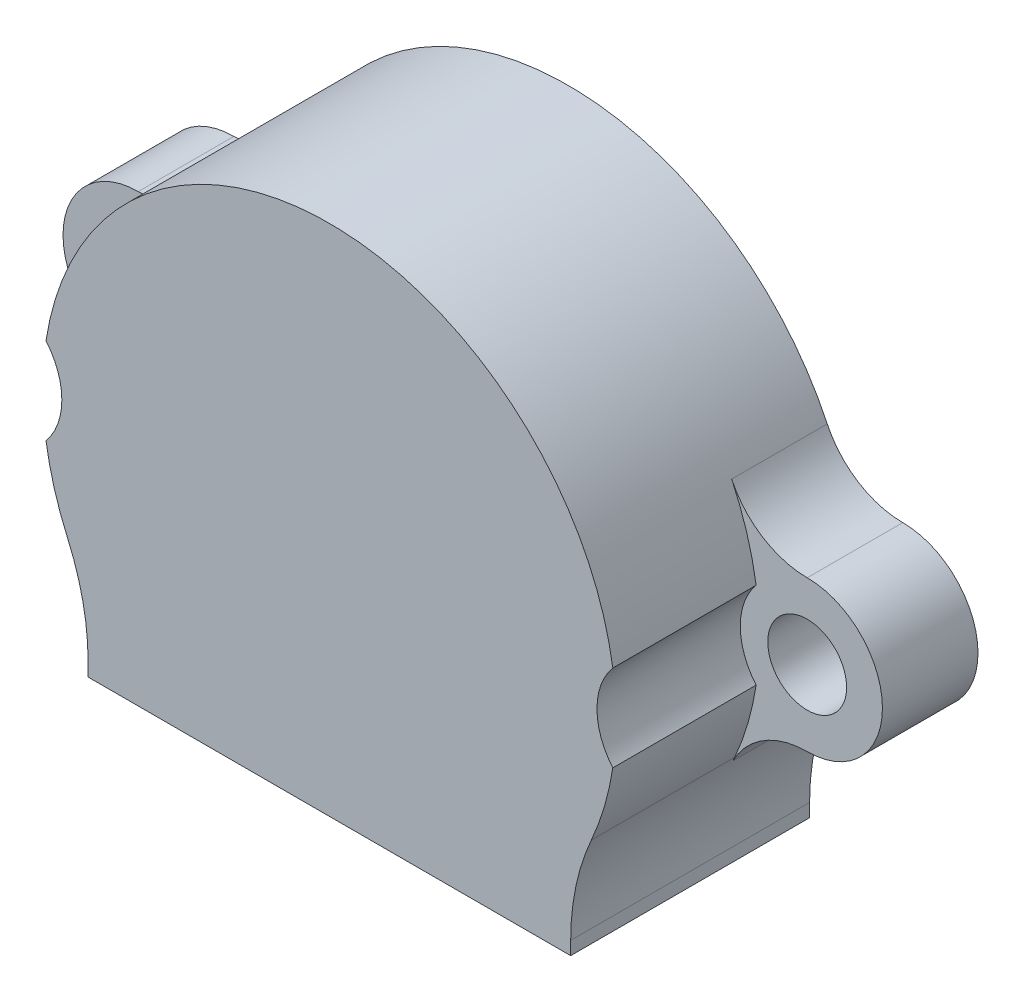
ISO-10303-21;
HEADER;
FILE_DESCRIPTION(('STEP AP214'),'2;1');
FILE_NAME('part.step','',(''),(''),'','','');
FILE_SCHEMA(('AUTOMOTIVE_DESIGN { 1 0 10303 214 1 1 1 1 }'));
ENDSEC;
DATA;
#1=APPLICATION_CONTEXT('core data for automotive mechanical design processes');
#2=APPLICATION_PROTOCOL_DEFINITION('international standard','automotive_design',2000,#1);
#3=PRODUCT_CONTEXT('',#1,'mechanical');
#4=PRODUCT('Part','Part','',(#3));
#5=PRODUCT_RELATED_PRODUCT_CATEGORY('part','',(#4));
#6=PRODUCT_DEFINITION_FORMATION('','',#4);
#7=PRODUCT_DEFINITION_CONTEXT('part definition',#1,'design');
#8=PRODUCT_DEFINITION('design','',#6,#7);
#9=PRODUCT_DEFINITION_SHAPE('','',#8);
#10=(LENGTH_UNIT() NAMED_UNIT(*) SI_UNIT(.MILLI.,.METRE.));
#11=(NAMED_UNIT(*) PLANE_ANGLE_UNIT() SI_UNIT($,.RADIAN.));
#12=(NAMED_UNIT(*) SI_UNIT($,.STERADIAN.) SOLID_ANGLE_UNIT());
#13=UNCERTAINTY_MEASURE_WITH_UNIT(LENGTH_MEASURE(1.E-05),#10,'distance_accuracy_value','');
#14=(GEOMETRIC_REPRESENTATION_CONTEXT(3) GLOBAL_UNCERTAINTY_ASSIGNED_CONTEXT((#13)) GLOBAL_UNIT_ASSIGNED_CONTEXT((#10,
#11,#12)) REPRESENTATION_CONTEXT('',''));
#15=CARTESIAN_POINT('',(0.,0.,0.));
#16=DIRECTION('',(0.,0.,1.));
#17=DIRECTION('',(1.,0.,0.));
#18=AXIS2_PLACEMENT_3D('',#15,#16,#17);
#19=CARTESIAN_POINT('',(0.,0.,10.));
#20=DIRECTION('',(0.,0.,-1.));
#21=DIRECTION('',(-1.,0.,0.));
#22=AXIS2_PLACEMENT_3D('',#19,#20,#21);
#23=CYLINDRICAL_SURFACE('',#22,12.);
#24=DIRECTION('',(0.,0.,-1.));
#25=VECTOR('',#24,1.);
#26=CARTESIAN_POINT('',(-11.8628571428571,1.80903853142028,7.));
#27=LINE('',#26,#25);
#28=CARTESIAN_POINT('',(-11.8628571428571,1.80903853142028,10.));
#29=VERTEX_POINT('',#28);
#30=CARTESIAN_POINT('',(-11.8628571428571,1.80903853142028,4.));
#31=VERTEX_POINT('',#30);
#32=EDGE_CURVE('E186',#29,#31,#27,.T.);
#33=ORIENTED_EDGE('',*,*,#32,.F.);
#34=CARTESIAN_POINT('',(0.,0.,10.));
#35=DIRECTION('',(0.,0.,1.));
#36=DIRECTION('',(1.,0.,0.));
#37=AXIS2_PLACEMENT_3D('',#34,#35,#36);
#38=CIRCLE('',#37,12.);
#39=CARTESIAN_POINT('',(11.8628571428571,1.80903853142028,10.));
#40=VERTEX_POINT('',#39);
#41=EDGE_CURVE('E276',#40,#29,#38,.T.);
#42=ORIENTED_EDGE('',*,*,#41,.F.);
#43=DIRECTION('',(0.,0.,-1.));
#44=VECTOR('',#43,1.);
#45=CARTESIAN_POINT('',(11.8628571428571,1.80903853142028,7.));
#46=LINE('',#45,#44);
#47=CARTESIAN_POINT('',(11.8628571428571,1.80903853142028,4.));
#48=VERTEX_POINT('',#47);
#49=EDGE_CURVE('E62',#48,#40,#46,.F.);
#50=ORIENTED_EDGE('',*,*,#49,.F.);
#51=CARTESIAN_POINT('',(0.,0.,4.));
#52=DIRECTION('',(0.,0.,1.));
#53=DIRECTION('',(-1.,0.,0.));
#54=AXIS2_PLACEMENT_3D('',#51,#52,#53);
#55=CIRCLE('',#54,12.);
#56=CARTESIAN_POINT('',(10.8397962252458,5.14770024332674,4.));
#57=VERTEX_POINT('',#56);
#58=EDGE_CURVE('E243',#48,#57,#55,.T.);
#59=ORIENTED_EDGE('',*,*,#58,.T.);
#60=DIRECTION('',(0.,0.,-1.));
#61=VECTOR('',#60,1.);
#62=CARTESIAN_POINT('',(10.8397962252458,5.14770024332674,4.));
#63=LINE('',#62,#61);
#64=CARTESIAN_POINT('',(10.8397962252458,5.14770024332674,0.));
#65=VERTEX_POINT('',#64);
#66=EDGE_CURVE('E254',#57,#65,#63,.T.);
#67=ORIENTED_EDGE('',*,*,#66,.T.);
#68=CARTESIAN_POINT('',(0.,0.,0.));
#69=DIRECTION('',(0.,0.,1.));
#70=DIRECTION('',(1.,0.,0.));
#71=AXIS2_PLACEMENT_3D('',#68,#69,#70);
#72=CIRCLE('',#71,12.);
#73=CARTESIAN_POINT('',(-10.8397962252458,5.14770024332674,0.));
#74=VERTEX_POINT('',#73);
#75=EDGE_CURVE('E271',#65,#74,#72,.T.);
#76=ORIENTED_EDGE('',*,*,#75,.T.);
#77=DIRECTION('',(0.,0.,-1.));
#78=VECTOR('',#77,1.);
#79=CARTESIAN_POINT('',(-10.8397962252458,5.14770024332674,4.));
#80=LINE('',#79,#78);
#81=CARTESIAN_POINT('',(-10.8397962252458,5.14770024332674,4.));
#82=VERTEX_POINT('',#81);
#83=EDGE_CURVE('E209',#82,#74,#80,.T.);
#84=ORIENTED_EDGE('',*,*,#83,.F.);
#85=CARTESIAN_POINT('',(0.,0.,4.));
#86=DIRECTION('',(0.,0.,1.));
#87=DIRECTION('',(1.,0.,0.));
#88=AXIS2_PLACEMENT_3D('',#85,#86,#87);
#89=CIRCLE('',#88,12.);
#90=EDGE_CURVE('E201',#82,#31,#89,.T.);
#91=ORIENTED_EDGE('',*,*,#90,.T.);
#92=EDGE_LOOP('',(#33,#42,#50,#59,#67,#76,#84,#91));
#93=FACE_BOUND('',#92,.T.);
#94=ADVANCED_FACE('F39',(#93),#23,.T.);
#95=DIRECTION('',(0.,0.,-1.));
#96=VECTOR('',#95,1.);
#97=CARTESIAN_POINT('',(-11.8628571428571,-1.80903853142028,7.));
#98=LINE('',#97,#96);
#99=CARTESIAN_POINT('',(-11.8628571428571,-1.80903853142028,4.));
#100=VERTEX_POINT('',#99);
#101=CARTESIAN_POINT('',(-11.8628571428571,-1.80903853142028,10.));
#102=VERTEX_POINT('',#101);
#103=EDGE_CURVE('E54',#100,#102,#98,.F.);
#104=ORIENTED_EDGE('',*,*,#103,.F.);
#105=CARTESIAN_POINT('',(-10.9636363636364,-4.87838884120059,4.));
#106=VERTEX_POINT('',#105);
#107=EDGE_CURVE('E204',#100,#106,#89,.T.);
#108=ORIENTED_EDGE('',*,*,#107,.T.);
#109=DIRECTION('',(0.,0.,-1.));
#110=VECTOR('',#109,1.);
#111=CARTESIAN_POINT('',(-10.9636363636364,-4.87838884120059,10.));
#112=LINE('',#111,#110);
#113=CARTESIAN_POINT('',(-10.9636363636364,-4.87838884120059,10.));
#114=VERTEX_POINT('',#113);
#115=EDGE_CURVE('E324',#106,#114,#112,.F.);
#116=ORIENTED_EDGE('',*,*,#115,.T.);
#117=EDGE_CURVE('E277',#102,#114,#38,.T.);
#118=ORIENTED_EDGE('',*,*,#117,.F.);
#119=EDGE_LOOP('',(#104,#108,#116,#118));
#120=FACE_BOUND('',#119,.T.);
#121=ADVANCED_FACE('F424',(#120),#23,.T.);
#122=DIRECTION('',(0.,0.,-1.));
#123=VECTOR('',#122,1.);
#124=CARTESIAN_POINT('',(11.8628571428571,-1.80903853142028,7.));
#125=LINE('',#124,#123);
#126=CARTESIAN_POINT('',(11.8628571428571,-1.80903853142028,10.));
#127=VERTEX_POINT('',#126);
#128=CARTESIAN_POINT('',(11.8628571428571,-1.80903853142028,4.));
#129=VERTEX_POINT('',#128);
#130=EDGE_CURVE('E364',#127,#129,#125,.T.);
#131=ORIENTED_EDGE('',*,*,#130,.F.);
#132=CARTESIAN_POINT('',(10.9636363636364,-4.87838884120059,10.));
#133=VERTEX_POINT('',#132);
#134=EDGE_CURVE('E272',#133,#127,#38,.T.);
#135=ORIENTED_EDGE('',*,*,#134,.F.);
#136=DIRECTION('',(0.,0.,-1.));
#137=VECTOR('',#136,1.);
#138=CARTESIAN_POINT('',(10.9636363636364,-4.87838884120059,10.));
#139=LINE('',#138,#137);
#140=CARTESIAN_POINT('',(10.9636363636364,-4.87838884120058,4.));
#141=VERTEX_POINT('',#140);
#142=EDGE_CURVE('E321',#133,#141,#139,.T.);
#143=ORIENTED_EDGE('',*,*,#142,.T.);
#144=EDGE_CURVE('E244',#141,#129,#55,.T.);
#145=ORIENTED_EDGE('',*,*,#144,.T.);
#146=EDGE_LOOP('',(#131,#135,#143,#145));
#147=FACE_BOUND('',#146,.T.);
#148=ADVANCED_FACE('F382',(#147),#23,.T.);
#149=CARTESIAN_POINT('',(-7.6,-4.13067791046458,10.));
#150=DIRECTION('',(-1.,0.,0.));
#151=DIRECTION('',(0.,-1.,0.));
#152=AXIS2_PLACEMENT_3D('',#149,#150,#151);
#153=PLANE('',#152);
#154=DIRECTION('',(0.,-1.,0.));
#155=VECTOR('',#154,1.);
#156=CARTESIAN_POINT('',(-7.6,-9.5,9.2));
#157=LINE('',#156,#155);
#158=CARTESIAN_POINT('',(-7.6,-4.13067791046457,9.2));
#159=VERTEX_POINT('',#158);
#160=CARTESIAN_POINT('',(-7.6,-9.5,9.2));
#161=VERTEX_POINT('',#160);
#162=EDGE_CURVE('E263',#159,#161,#157,.T.);
#163=ORIENTED_EDGE('',*,*,#162,.T.);
#164=DIRECTION('',(0.,0.,-1.));
#165=VECTOR('',#164,1.);
#166=CARTESIAN_POINT('',(-7.6,-9.5,10.));
#167=LINE('',#166,#165);
#168=CARTESIAN_POINT('',(-7.6,-9.5,0.));
#169=VERTEX_POINT('',#168);
#170=EDGE_CURVE('E313',#161,#169,#167,.T.);
#171=ORIENTED_EDGE('',*,*,#170,.T.);
#172=DIRECTION('',(0.,1.,0.));
#173=VECTOR('',#172,1.);
#174=CARTESIAN_POINT('',(-7.6,-4.13067791046458,0.));
#175=LINE('',#174,#173);
#176=CARTESIAN_POINT('',(-7.6,-4.13067791046457,0.));
#177=VERTEX_POINT('',#176);
#178=EDGE_CURVE('E291',#169,#177,#175,.T.);
#179=ORIENTED_EDGE('',*,*,#178,.T.);
#180=DIRECTION('',(0.,0.,-1.));
#181=VECTOR('',#180,1.);
#182=CARTESIAN_POINT('',(-7.6,-4.13067791046457,10.));
#183=LINE('',#182,#181);
#184=EDGE_CURVE('E311',#159,#177,#183,.T.);
#185=ORIENTED_EDGE('',*,*,#184,.F.);
#186=EDGE_LOOP('',(#163,#171,#179,#185));
#187=FACE_BOUND('',#186,.T.);
#188=ADVANCED_FACE('F431',(#187),#153,.F.);
#189=CARTESIAN_POINT('',(0.,0.,10.));
#190=DIRECTION('',(0.,0.,-1.));
#191=DIRECTION('',(-1.,0.,0.));
#192=AXIS2_PLACEMENT_3D('',#189,#190,#191);
#193=CYLINDRICAL_SURFACE('',#192,8.65);
#194=CARTESIAN_POINT('',(0.,0.,9.2));
#195=DIRECTION('',(0.,0.,1.));
#196=DIRECTION('',(1.,0.,0.));
#197=AXIS2_PLACEMENT_3D('',#194,#195,#196);
#198=CIRCLE('',#197,8.65);
#199=CARTESIAN_POINT('',(7.6,-4.13067791046458,9.2));
#200=VERTEX_POINT('',#199);
#201=EDGE_CURVE('E257',#200,#159,#198,.T.);
#202=ORIENTED_EDGE('',*,*,#201,.T.);
#203=ORIENTED_EDGE('',*,*,#184,.T.);
#204=CARTESIAN_POINT('',(0.,0.,0.));
#205=DIRECTION('',(0.,0.,-1.));
#206=DIRECTION('',(1.,0.,0.));
#207=AXIS2_PLACEMENT_3D('',#204,#205,#206);
#208=CIRCLE('',#207,8.65);
#209=CARTESIAN_POINT('',(7.6,-4.13067791046458,0.));
#210=VERTEX_POINT('',#209);
#211=EDGE_CURVE('E294',#177,#210,#208,.T.);
#212=ORIENTED_EDGE('',*,*,#211,.T.);
#213=DIRECTION('',(0.,0.,-1.));
#214=VECTOR('',#213,1.);
#215=CARTESIAN_POINT('',(7.6,-4.13067791046458,10.));
#216=LINE('',#215,#214);
#217=EDGE_CURVE('E309',#200,#210,#216,.T.);
#218=ORIENTED_EDGE('',*,*,#217,.F.);
#219=EDGE_LOOP('',(#202,#203,#212,#218));
#220=FACE_BOUND('',#219,.T.);
#221=ADVANCED_FACE('F463',(#220),#193,.F.);
#222=CARTESIAN_POINT('',(7.6,-9.5,10.));
#223=DIRECTION('',(1.,0.,0.));
#224=DIRECTION('',(0.,1.,0.));
#225=AXIS2_PLACEMENT_3D('',#222,#223,#224);
#226=PLANE('',#225);
#227=DIRECTION('',(0.,1.,0.));
#228=VECTOR('',#227,1.);
#229=CARTESIAN_POINT('',(7.6,-4.13067791046458,9.2));
#230=LINE('',#229,#228);
#231=CARTESIAN_POINT('',(7.6,-9.5,9.2));
#232=VERTEX_POINT('',#231);
#233=EDGE_CURVE('E268',#232,#200,#230,.T.);
#234=ORIENTED_EDGE('',*,*,#233,.T.);
#235=ORIENTED_EDGE('',*,*,#217,.T.);
#236=DIRECTION('',(0.,-1.,0.));
#237=VECTOR('',#236,1.);
#238=CARTESIAN_POINT('',(7.6,-9.5,0.));
#239=LINE('',#238,#237);
#240=CARTESIAN_POINT('',(7.6,-9.5,0.));
#241=VERTEX_POINT('',#240);
#242=EDGE_CURVE('E297',#210,#241,#239,.T.);
#243=ORIENTED_EDGE('',*,*,#242,.T.);
#244=DIRECTION('',(0.,0.,-1.));
#245=VECTOR('',#244,1.);
#246=CARTESIAN_POINT('',(7.6,-9.5,10.));
#247=LINE('',#246,#245);
#248=EDGE_CURVE('E307',#232,#241,#247,.T.);
#249=ORIENTED_EDGE('',*,*,#248,.F.);
#250=EDGE_LOOP('',(#234,#235,#243,#249));
#251=FACE_BOUND('',#250,.T.);
#252=ADVANCED_FACE('F460',(#251),#226,.F.);
#253=CARTESIAN_POINT('',(-10.1,-9.5,10.));
#254=DIRECTION('',(1.,0.,0.));
#255=DIRECTION('',(0.,1.,0.));
#256=AXIS2_PLACEMENT_3D('',#253,#254,#255);
#257=PLANE('',#256);
#258=DIRECTION('',(0.,-1.,0.));
#259=VECTOR('',#258,1.);
#260=CARTESIAN_POINT('',(-10.1,-9.5,10.));
#261=LINE('',#260,#259);
#262=CARTESIAN_POINT('',(-10.1,-8.94371287553442,10.));
#263=VERTEX_POINT('',#262);
#264=CARTESIAN_POINT('',(-10.1,-9.5,10.));
#265=VERTEX_POINT('',#264);
#266=EDGE_CURVE('E275',#263,#265,#261,.T.);
#267=ORIENTED_EDGE('',*,*,#266,.F.);
#268=DIRECTION('',(0.,0.,1.));
#269=VECTOR('',#268,1.);
#270=CARTESIAN_POINT('',(-10.1,-8.94371287553442,0.));
#271=LINE('',#270,#269);
#272=CARTESIAN_POINT('',(-10.1,-8.94371287553442,0.));
#273=VERTEX_POINT('',#272);
#274=EDGE_CURVE('E318',#263,#273,#271,.F.);
#275=ORIENTED_EDGE('',*,*,#274,.T.);
#276=DIRECTION('',(0.,-1.,0.));
#277=VECTOR('',#276,1.);
#278=CARTESIAN_POINT('',(-10.1,-9.5,0.));
#279=LINE('',#278,#277);
#280=CARTESIAN_POINT('',(-10.1,-9.5,0.));
#281=VERTEX_POINT('',#280);
#282=EDGE_CURVE('E286',#273,#281,#279,.T.);
#283=ORIENTED_EDGE('',*,*,#282,.T.);
#284=DIRECTION('',(0.,0.,-1.));
#285=VECTOR('',#284,1.);
#286=CARTESIAN_POINT('',(-10.1,-9.5,10.));
#287=LINE('',#286,#285);
#288=EDGE_CURVE('E315',#265,#281,#287,.T.);
#289=ORIENTED_EDGE('',*,*,#288,.F.);
#290=EDGE_LOOP('',(#267,#275,#283,#289));
#291=FACE_BOUND('',#290,.T.);
#292=ADVANCED_FACE('F416',(#291),#257,.F.);
#293=CARTESIAN_POINT('',(10.1,-9.5,10.));
#294=DIRECTION('',(0.,1.,0.));
#295=DIRECTION('',(-1.,0.,0.));
#296=AXIS2_PLACEMENT_3D('',#293,#294,#295);
#297=PLANE('',#296);
#298=DIRECTION('',(1.,0.,0.));
#299=VECTOR('',#298,1.);
#300=CARTESIAN_POINT('',(10.1,-9.5,0.));
#301=LINE('',#300,#299);
#302=CARTESIAN_POINT('',(10.1,-9.5,0.));
#303=VERTEX_POINT('',#302);
#304=EDGE_CURVE('E300',#241,#303,#301,.T.);
#305=ORIENTED_EDGE('',*,*,#304,.T.);
#306=DIRECTION('',(0.,0.,-1.));
#307=VECTOR('',#306,1.);
#308=CARTESIAN_POINT('',(10.1,-9.5,10.));
#309=LINE('',#308,#307);
#310=CARTESIAN_POINT('',(10.1,-9.5,10.));
#311=VERTEX_POINT('',#310);
#312=EDGE_CURVE('E284',#311,#303,#309,.T.);
#313=ORIENTED_EDGE('',*,*,#312,.F.);
#314=DIRECTION('',(1.,0.,0.));
#315=VECTOR('',#314,1.);
#316=CARTESIAN_POINT('',(-7.6,-9.5,10.));
#317=LINE('',#316,#315);
#318=EDGE_CURVE('E279',#265,#311,#317,.T.);
#319=ORIENTED_EDGE('',*,*,#318,.F.);
#320=ORIENTED_EDGE('',*,*,#288,.T.);
#321=DIRECTION('',(1.,0.,0.));
#322=VECTOR('',#321,1.);
#323=CARTESIAN_POINT('',(-7.6,-9.5,0.));
#324=LINE('',#323,#322);
#325=EDGE_CURVE('E288',#281,#169,#324,.T.);
#326=ORIENTED_EDGE('',*,*,#325,.T.);
#327=ORIENTED_EDGE('',*,*,#170,.F.);
#328=DIRECTION('',(1.,0.,0.));
#329=VECTOR('',#328,1.);
#330=CARTESIAN_POINT('',(-7.6,-9.5,9.2));
#331=LINE('',#330,#329);
#332=EDGE_CURVE('E266',#161,#232,#331,.T.);
#333=ORIENTED_EDGE('',*,*,#332,.T.);
#334=ORIENTED_EDGE('',*,*,#248,.T.);
#335=EDGE_LOOP('',(#305,#313,#319,#320,#326,#327,#333,#334));
#336=FACE_BOUND('',#335,.T.);
#337=ADVANCED_FACE('F456',(#336),#297,.F.);
#338=CARTESIAN_POINT('',(10.1,-6.47996913572897,10.));
#339=DIRECTION('',(-1.,0.,0.));
#340=DIRECTION('',(0.,-1.,0.));
#341=AXIS2_PLACEMENT_3D('',#338,#339,#340);
#342=PLANE('',#341);
#343=DIRECTION('',(0.,1.,0.));
#344=VECTOR('',#343,1.);
#345=CARTESIAN_POINT('',(10.1,-6.47996913572897,0.));
#346=LINE('',#345,#344);
#347=CARTESIAN_POINT('',(10.1,-8.94371287553441,0.));
#348=VERTEX_POINT('',#347);
#349=EDGE_CURVE('E302',#303,#348,#346,.T.);
#350=ORIENTED_EDGE('',*,*,#349,.T.);
#351=DIRECTION('',(0.,0.,1.));
#352=VECTOR('',#351,1.);
#353=CARTESIAN_POINT('',(10.1,-8.94371287553441,10.));
#354=LINE('',#353,#352);
#355=CARTESIAN_POINT('',(10.1,-8.94371287553441,10.));
#356=VERTEX_POINT('',#355);
#357=EDGE_CURVE('E327',#348,#356,#354,.T.);
#358=ORIENTED_EDGE('',*,*,#357,.T.);
#359=DIRECTION('',(0.,1.,0.));
#360=VECTOR('',#359,1.);
#361=CARTESIAN_POINT('',(10.1,-6.47996913572897,10.));
#362=LINE('',#361,#360);
#363=EDGE_CURVE('E281',#311,#356,#362,.T.);
#364=ORIENTED_EDGE('',*,*,#363,.F.);
#365=ORIENTED_EDGE('',*,*,#312,.T.);
#366=EDGE_LOOP('',(#350,#358,#364,#365));
#367=FACE_BOUND('',#366,.T.);
#368=ADVANCED_FACE('F452',(#367),#342,.F.);
#369=CARTESIAN_POINT('',(0.,0.,10.));
#370=DIRECTION('',(0.,0.,1.));
#371=DIRECTION('',(1.,0.,0.));
#372=AXIS2_PLACEMENT_3D('',#369,#370,#371);
#373=PLANE('',#372);
#374=ORIENTED_EDGE('',*,*,#41,.T.);
#375=CARTESIAN_POINT('',(-14.,0.,10.));
#376=DIRECTION('',(0.,0.,1.));
#377=DIRECTION('',(1.,0.,0.));
#378=AXIS2_PLACEMENT_3D('',#375,#376,#377);
#379=CIRCLE('',#378,2.8);
#380=EDGE_CURVE('E190',#102,#29,#379,.T.);
#381=ORIENTED_EDGE('',*,*,#380,.F.);
#382=ORIENTED_EDGE('',*,*,#117,.T.);
#383=CARTESIAN_POINT('',(-20.1,-8.94371287553441,10.));
#384=DIRECTION('',(0.,0.,1.));
#385=DIRECTION('',(1.,0.,0.));
#386=AXIS2_PLACEMENT_3D('',#383,#384,#385);
#387=CIRCLE('',#386,10.);
#388=EDGE_CURVE('E332',#114,#263,#387,.F.);
#389=ORIENTED_EDGE('',*,*,#388,.T.);
#390=ORIENTED_EDGE('',*,*,#266,.T.);
#391=ORIENTED_EDGE('',*,*,#318,.T.);
#392=ORIENTED_EDGE('',*,*,#363,.T.);
#393=CARTESIAN_POINT('',(20.1,-8.94371287553441,10.));
#394=DIRECTION('',(0.,0.,1.));
#395=DIRECTION('',(1.,0.,0.));
#396=AXIS2_PLACEMENT_3D('',#393,#394,#395);
#397=CIRCLE('',#396,10.);
#398=EDGE_CURVE('E336',#356,#133,#397,.F.);
#399=ORIENTED_EDGE('',*,*,#398,.T.);
#400=ORIENTED_EDGE('',*,*,#134,.T.);
#401=CARTESIAN_POINT('',(14.,0.,10.));
#402=DIRECTION('',(0.,0.,1.));
#403=DIRECTION('',(1.,0.,0.));
#404=AXIS2_PLACEMENT_3D('',#401,#402,#403);
#405=CIRCLE('',#404,2.8);
#406=EDGE_CURVE('E370',#40,#127,#405,.T.);
#407=ORIENTED_EDGE('',*,*,#406,.F.);
#408=EDGE_LOOP('',(#374,#381,#382,#389,#390,#391,#392,#399,#400,#407));
#409=FACE_BOUND('',#408,.T.);
#410=ADVANCED_FACE('F420',(#409),#373,.T.);
#411=CARTESIAN_POINT('',(0.,0.,0.));
#412=DIRECTION('',(0.,0.,1.));
#413=DIRECTION('',(1.,0.,0.));
#414=AXIS2_PLACEMENT_3D('',#411,#412,#413);
#415=PLANE('',#414);
#416=CARTESIAN_POINT('',(-14.,6.64844632768362,0.));
#417=DIRECTION('',(0.,0.,1.));
#418=DIRECTION('',(1.,0.,0.));
#419=AXIS2_PLACEMENT_3D('',#416,#417,#418);
#420=CIRCLE('',#419,3.49844632768362);
#421=CARTESIAN_POINT('',(-14.,3.15,0.));
#422=VERTEX_POINT('',#421);
#423=EDGE_CURVE('E210',#422,#74,#420,.T.);
#424=ORIENTED_EDGE('',*,*,#423,.T.);
#425=ORIENTED_EDGE('',*,*,#75,.F.);
#426=CARTESIAN_POINT('',(14.,6.64844632768362,0.));
#427=DIRECTION('',(0.,0.,1.));
#428=DIRECTION('',(-1.,0.,0.));
#429=AXIS2_PLACEMENT_3D('',#426,#427,#428);
#430=CIRCLE('',#429,3.49844632768362);
#431=CARTESIAN_POINT('',(14.,3.15,0.));
#432=VERTEX_POINT('',#431);
#433=EDGE_CURVE('E230',#65,#432,#430,.T.);
#434=ORIENTED_EDGE('',*,*,#433,.T.);
#435=CARTESIAN_POINT('',(14.,0.,0.));
#436=DIRECTION('',(0.,0.,-1.));
#437=DIRECTION('',(-1.,0.,0.));
#438=AXIS2_PLACEMENT_3D('',#435,#436,#437);
#439=CIRCLE('',#438,3.15);
#440=CARTESIAN_POINT('',(14.,-3.15,0.));
#441=VERTEX_POINT('',#440);
#442=EDGE_CURVE('E250',#432,#441,#439,.T.);
#443=ORIENTED_EDGE('',*,*,#442,.T.);
#444=CARTESIAN_POINT('',(14.,-6.64844632768362,0.));
#445=DIRECTION('',(0.,0.,1.));
#446=DIRECTION('',(1.,0.,0.));
#447=AXIS2_PLACEMENT_3D('',#444,#445,#446);
#448=CIRCLE('',#447,3.49844632768362);
#449=CARTESIAN_POINT('',(10.8943093932502,-5.03791456369107,0.));
#450=VERTEX_POINT('',#449);
#451=EDGE_CURVE('E237',#441,#450,#448,.T.);
#452=ORIENTED_EDGE('',*,*,#451,.T.);
#453=CARTESIAN_POINT('',(20.1,-8.94371287553441,0.));
#454=DIRECTION('',(0.,0.,1.));
#455=DIRECTION('',(1.,0.,0.));
#456=AXIS2_PLACEMENT_3D('',#453,#454,#455);
#457=CIRCLE('',#456,10.);
#458=EDGE_CURVE('E334',#450,#348,#457,.T.);
#459=ORIENTED_EDGE('',*,*,#458,.T.);
#460=ORIENTED_EDGE('',*,*,#349,.F.);
#461=ORIENTED_EDGE('',*,*,#304,.F.);
#462=ORIENTED_EDGE('',*,*,#242,.F.);
#463=ORIENTED_EDGE('',*,*,#211,.F.);
#464=ORIENTED_EDGE('',*,*,#178,.F.);
#465=ORIENTED_EDGE('',*,*,#325,.F.);
#466=ORIENTED_EDGE('',*,*,#282,.F.);
#467=CARTESIAN_POINT('',(-20.1,-8.94371287553441,0.));
#468=DIRECTION('',(0.,0.,1.));
#469=DIRECTION('',(1.,0.,0.));
#470=AXIS2_PLACEMENT_3D('',#467,#468,#469);
#471=CIRCLE('',#470,10.);
#472=CARTESIAN_POINT('',(-10.8943093932502,-5.03791456369108,0.));
#473=VERTEX_POINT('',#472);
#474=EDGE_CURVE('E329',#273,#473,#471,.T.);
#475=ORIENTED_EDGE('',*,*,#474,.T.);
#476=CARTESIAN_POINT('',(-14.,-6.64844632768362,0.));
#477=DIRECTION('',(0.,0.,1.));
#478=DIRECTION('',(-1.,0.,0.));
#479=AXIS2_PLACEMENT_3D('',#476,#477,#478);
#480=CIRCLE('',#479,3.49844632768362);
#481=CARTESIAN_POINT('',(-14.,-3.15,0.));
#482=VERTEX_POINT('',#481);
#483=EDGE_CURVE('E226',#473,#482,#480,.T.);
#484=ORIENTED_EDGE('',*,*,#483,.T.);
#485=CARTESIAN_POINT('',(-14.,0.,0.));
#486=DIRECTION('',(0.,0.,-1.));
#487=DIRECTION('',(1.,0.,0.));
#488=AXIS2_PLACEMENT_3D('',#485,#486,#487);
#489=CIRCLE('',#488,3.15);
#490=EDGE_CURVE('E213',#482,#422,#489,.T.);
#491=ORIENTED_EDGE('',*,*,#490,.T.);
#492=EDGE_LOOP('',(#424,#425,#434,#443,#452,#459,#460,#461,#462,#463,#464,#465,#466,#475,#484,#491));
#493=FACE_BOUND('',#492,.T.);
#494=CARTESIAN_POINT('',(-14.,0.,0.));
#495=DIRECTION('',(0.,0.,-1.));
#496=DIRECTION('',(-1.,0.,0.));
#497=AXIS2_PLACEMENT_3D('',#494,#495,#496);
#498=CIRCLE('',#497,1.65);
#499=CARTESIAN_POINT('',(-15.65,0.,0.));
#500=VERTEX_POINT('',#499);
#501=EDGE_CURVE('E219',#500,#500,#498,.T.);
#502=ORIENTED_EDGE('',*,*,#501,.F.);
#503=EDGE_LOOP('',(#502));
#504=FACE_BOUND('',#503,.T.);
#505=CARTESIAN_POINT('',(14.,0.,0.));
#506=DIRECTION('',(0.,0.,-1.));
#507=DIRECTION('',(1.,0.,0.));
#508=AXIS2_PLACEMENT_3D('',#505,#506,#507);
#509=CIRCLE('',#508,1.65);
#510=CARTESIAN_POINT('',(15.65,0.,0.));
#511=VERTEX_POINT('',#510);
#512=EDGE_CURVE('E222',#511,#511,#509,.T.);
#513=ORIENTED_EDGE('',*,*,#512,.F.);
#514=EDGE_LOOP('',(#513));
#515=FACE_BOUND('',#514,.T.);
#516=ADVANCED_FACE('F403',(#493,#504,#515),#415,.F.);
#517=CARTESIAN_POINT('',(0.,0.,9.2));
#518=DIRECTION('',(0.,0.,1.));
#519=DIRECTION('',(1.,0.,0.));
#520=AXIS2_PLACEMENT_3D('',#517,#518,#519);
#521=PLANE('',#520);
#522=ORIENTED_EDGE('',*,*,#201,.F.);
#523=ORIENTED_EDGE('',*,*,#233,.F.);
#524=ORIENTED_EDGE('',*,*,#332,.F.);
#525=ORIENTED_EDGE('',*,*,#162,.F.);
#526=EDGE_LOOP('',(#522,#523,#524,#525));
#527=FACE_BOUND('',#526,.T.);
#528=ADVANCED_FACE('F435',(#527),#521,.F.);
#529=CARTESIAN_POINT('',(-20.1,-8.94371287553441,10.));
#530=DIRECTION('',(0.,0.,-1.));
#531=DIRECTION('',(-1.,0.,0.));
#532=AXIS2_PLACEMENT_3D('',#529,#530,#531);
#533=CYLINDRICAL_SURFACE('',#532,10.);
#534=CARTESIAN_POINT('',(-20.1,-8.94371287553441,4.));
#535=DIRECTION('',(0.,0.,1.));
#536=DIRECTION('',(1.,0.,0.));
#537=AXIS2_PLACEMENT_3D('',#534,#535,#536);
#538=CIRCLE('',#537,10.);
#539=CARTESIAN_POINT('',(-10.8943093932502,-5.03791456369108,4.));
#540=VERTEX_POINT('',#539);
#541=EDGE_CURVE('E47',#106,#540,#538,.F.);
#542=ORIENTED_EDGE('',*,*,#541,.T.);
#543=DIRECTION('',(0.,0.,-1.));
#544=VECTOR('',#543,1.);
#545=CARTESIAN_POINT('',(-10.8943093932502,-5.03791456369106,2.));
#546=LINE('',#545,#544);
#547=EDGE_CURVE('E11',#540,#473,#546,.T.);
#548=ORIENTED_EDGE('',*,*,#547,.T.);
#549=ORIENTED_EDGE('',*,*,#474,.F.);
#550=ORIENTED_EDGE('',*,*,#274,.F.);
#551=ORIENTED_EDGE('',*,*,#388,.F.);
#552=ORIENTED_EDGE('',*,*,#115,.F.);
#553=EDGE_LOOP('',(#542,#548,#549,#550,#551,#552));
#554=FACE_BOUND('',#553,.T.);
#555=ADVANCED_FACE('F345',(#554),#533,.F.);
#556=CARTESIAN_POINT('',(20.1,-8.94371287553441,10.));
#557=DIRECTION('',(0.,0.,-1.));
#558=DIRECTION('',(-1.,0.,0.));
#559=AXIS2_PLACEMENT_3D('',#556,#557,#558);
#560=CYLINDRICAL_SURFACE('',#559,10.);
#561=ORIENTED_EDGE('',*,*,#458,.F.);
#562=DIRECTION('',(0.,0.,-1.));
#563=VECTOR('',#562,1.);
#564=CARTESIAN_POINT('',(10.8943093932502,-5.03791456369107,2.));
#565=LINE('',#564,#563);
#566=CARTESIAN_POINT('',(10.8943093932502,-5.03791456369107,4.));
#567=VERTEX_POINT('',#566);
#568=EDGE_CURVE('E340',#450,#567,#565,.F.);
#569=ORIENTED_EDGE('',*,*,#568,.T.);
#570=CARTESIAN_POINT('',(20.1,-8.94371287553441,4.));
#571=DIRECTION('',(0.,0.,-1.));
#572=DIRECTION('',(-1.,0.,0.));
#573=AXIS2_PLACEMENT_3D('',#570,#571,#572);
#574=CIRCLE('',#573,10.);
#575=EDGE_CURVE('E338',#141,#567,#574,.F.);
#576=ORIENTED_EDGE('',*,*,#575,.F.);
#577=ORIENTED_EDGE('',*,*,#142,.F.);
#578=ORIENTED_EDGE('',*,*,#398,.F.);
#579=ORIENTED_EDGE('',*,*,#357,.F.);
#580=EDGE_LOOP('',(#561,#569,#576,#577,#578,#579));
#581=FACE_BOUND('',#580,.T.);
#582=ADVANCED_FACE('F41',(#581),#560,.F.);
#583=CARTESIAN_POINT('',(14.,-6.64844632768362,4.));
#584=DIRECTION('',(0.,0.,-1.));
#585=DIRECTION('',(-1.,0.,0.));
#586=AXIS2_PLACEMENT_3D('',#583,#584,#585);
#587=CYLINDRICAL_SURFACE('',#586,3.49844632768362);
#588=ORIENTED_EDGE('',*,*,#568,.F.);
#589=ORIENTED_EDGE('',*,*,#451,.F.);
#590=DIRECTION('',(0.,0.,-1.));
#591=VECTOR('',#590,1.);
#592=CARTESIAN_POINT('',(14.,-3.15,4.));
#593=LINE('',#592,#591);
#594=CARTESIAN_POINT('',(14.,-3.15,4.));
#595=VERTEX_POINT('',#594);
#596=EDGE_CURVE('E258',#595,#441,#593,.T.);
#597=ORIENTED_EDGE('',*,*,#596,.F.);
#598=CARTESIAN_POINT('',(14.,-6.64844632768362,4.));
#599=DIRECTION('',(0.,0.,1.));
#600=DIRECTION('',(1.,0.,0.));
#601=AXIS2_PLACEMENT_3D('',#598,#599,#600);
#602=CIRCLE('',#601,3.49844632768362);
#603=EDGE_CURVE('E240',#595,#567,#602,.T.);
#604=ORIENTED_EDGE('',*,*,#603,.T.);
#605=EDGE_LOOP('',(#588,#589,#597,#604));
#606=FACE_BOUND('',#605,.T.);
#607=ADVANCED_FACE('F393',(#606),#587,.F.);
#608=CARTESIAN_POINT('',(7.,3.32422316384181,4.));
#609=DIRECTION('',(0.,0.,-1.));
#610=DIRECTION('',(-1.,0.,0.));
#611=AXIS2_PLACEMENT_3D('',#608,#609,#610);
#612=PLANE('',#611);
#613=ORIENTED_EDGE('',*,*,#58,.F.);
#614=CARTESIAN_POINT('',(14.,0.,4.));
#615=DIRECTION('',(0.,0.,1.));
#616=DIRECTION('',(1.,0.,0.));
#617=AXIS2_PLACEMENT_3D('',#614,#615,#616);
#618=CIRCLE('',#617,2.8);
#619=EDGE_CURVE('E205',#48,#129,#618,.T.);
#620=ORIENTED_EDGE('',*,*,#619,.T.);
#621=ORIENTED_EDGE('',*,*,#144,.F.);
#622=ORIENTED_EDGE('',*,*,#575,.T.);
#623=ORIENTED_EDGE('',*,*,#603,.F.);
#624=CARTESIAN_POINT('',(14.,0.,4.));
#625=DIRECTION('',(0.,0.,-1.));
#626=DIRECTION('',(-1.,0.,0.));
#627=AXIS2_PLACEMENT_3D('',#624,#625,#626);
#628=CIRCLE('',#627,3.15);
#629=CARTESIAN_POINT('',(14.,3.15,4.));
#630=VERTEX_POINT('',#629);
#631=EDGE_CURVE('E236',#630,#595,#628,.T.);
#632=ORIENTED_EDGE('',*,*,#631,.F.);
#633=CARTESIAN_POINT('',(14.,6.64844632768362,4.));
#634=DIRECTION('',(0.,0.,1.));
#635=DIRECTION('',(-1.,0.,0.));
#636=AXIS2_PLACEMENT_3D('',#633,#634,#635);
#637=CIRCLE('',#636,3.49844632768362);
#638=EDGE_CURVE('E233',#57,#630,#637,.T.);
#639=ORIENTED_EDGE('',*,*,#638,.F.);
#640=EDGE_LOOP('',(#613,#620,#621,#622,#623,#632,#639));
#641=FACE_BOUND('',#640,.T.);
#642=CARTESIAN_POINT('',(14.,0.,4.));
#643=DIRECTION('',(0.,0.,-1.));
#644=DIRECTION('',(1.,0.,0.));
#645=AXIS2_PLACEMENT_3D('',#642,#643,#644);
#646=CIRCLE('',#645,1.65);
#647=CARTESIAN_POINT('',(15.65,0.,4.));
#648=VERTEX_POINT('',#647);
#649=EDGE_CURVE('E227',#648,#648,#646,.T.);
#650=ORIENTED_EDGE('',*,*,#649,.T.);
#651=EDGE_LOOP('',(#650));
#652=FACE_BOUND('',#651,.T.);
#653=ADVANCED_FACE('F376',(#641,#652),#612,.F.);
#654=CARTESIAN_POINT('',(14.,6.64844632768362,4.));
#655=DIRECTION('',(0.,0.,-1.));
#656=DIRECTION('',(-1.,0.,0.));
#657=AXIS2_PLACEMENT_3D('',#654,#655,#656);
#658=CYLINDRICAL_SURFACE('',#657,3.49844632768362);
#659=ORIENTED_EDGE('',*,*,#433,.F.);
#660=ORIENTED_EDGE('',*,*,#66,.F.);
#661=ORIENTED_EDGE('',*,*,#638,.T.);
#662=DIRECTION('',(0.,0.,-1.));
#663=VECTOR('',#662,1.);
#664=CARTESIAN_POINT('',(14.,3.15,4.));
#665=LINE('',#664,#663);
#666=EDGE_CURVE('E247',#630,#432,#665,.T.);
#667=ORIENTED_EDGE('',*,*,#666,.T.);
#668=EDGE_LOOP('',(#659,#660,#661,#667));
#669=FACE_BOUND('',#668,.T.);
#670=ADVANCED_FACE('F400',(#669),#658,.F.);
#671=CARTESIAN_POINT('',(14.,0.,4.));
#672=DIRECTION('',(0.,0.,-1.));
#673=DIRECTION('',(-1.,0.,0.));
#674=AXIS2_PLACEMENT_3D('',#671,#672,#673);
#675=CYLINDRICAL_SURFACE('',#674,3.15);
#676=ORIENTED_EDGE('',*,*,#442,.F.);
#677=ORIENTED_EDGE('',*,*,#666,.F.);
#678=ORIENTED_EDGE('',*,*,#631,.T.);
#679=ORIENTED_EDGE('',*,*,#596,.T.);
#680=EDGE_LOOP('',(#676,#677,#678,#679));
#681=FACE_BOUND('',#680,.T.);
#682=ADVANCED_FACE('F397',(#681),#675,.T.);
#683=CARTESIAN_POINT('',(14.,0.,4.));
#684=DIRECTION('',(0.,0.,-1.));
#685=DIRECTION('',(-1.,0.,0.));
#686=AXIS2_PLACEMENT_3D('',#683,#684,#685);
#687=CYLINDRICAL_SURFACE('',#686,1.65);
#688=ORIENTED_EDGE('',*,*,#649,.F.);
#689=EDGE_LOOP('',(#688));
#690=FACE_BOUND('',#689,.T.);
#691=ORIENTED_EDGE('',*,*,#512,.T.);
#692=EDGE_LOOP('',(#691));
#693=FACE_BOUND('',#692,.T.);
#694=ADVANCED_FACE('F497',(#690,#693),#687,.F.);
#695=CARTESIAN_POINT('',(-14.,-6.64844632768362,4.));
#696=DIRECTION('',(0.,0.,-1.));
#697=DIRECTION('',(-1.,0.,0.));
#698=AXIS2_PLACEMENT_3D('',#695,#696,#697);
#699=CYLINDRICAL_SURFACE('',#698,3.49844632768362);
#700=ORIENTED_EDGE('',*,*,#547,.F.);
#701=CARTESIAN_POINT('',(-14.,-6.64844632768362,4.));
#702=DIRECTION('',(0.,0.,1.));
#703=DIRECTION('',(-1.,0.,0.));
#704=AXIS2_PLACEMENT_3D('',#701,#702,#703);
#705=CIRCLE('',#704,3.49844632768362);
#706=CARTESIAN_POINT('',(-14.,-3.15,4.));
#707=VERTEX_POINT('',#706);
#708=EDGE_CURVE('E215',#540,#707,#705,.T.);
#709=ORIENTED_EDGE('',*,*,#708,.T.);
#710=DIRECTION('',(0.,0.,-1.));
#711=VECTOR('',#710,1.);
#712=CARTESIAN_POINT('',(-14.,-3.15,4.));
#713=LINE('',#712,#711);
#714=EDGE_CURVE('E356',#707,#482,#713,.T.);
#715=ORIENTED_EDGE('',*,*,#714,.T.);
#716=ORIENTED_EDGE('',*,*,#483,.F.);
#717=EDGE_LOOP('',(#700,#709,#715,#716));
#718=FACE_BOUND('',#717,.T.);
#719=ADVANCED_FACE('F410',(#718),#699,.F.);
#720=CARTESIAN_POINT('',(-7.,-3.32422316384181,4.));
#721=DIRECTION('',(0.,0.,1.));
#722=DIRECTION('',(1.,0.,0.));
#723=AXIS2_PLACEMENT_3D('',#720,#721,#722);
#724=PLANE('',#723);
#725=ORIENTED_EDGE('',*,*,#107,.F.);
#726=CARTESIAN_POINT('',(-14.,0.,4.));
#727=DIRECTION('',(0.,0.,1.));
#728=DIRECTION('',(1.,0.,0.));
#729=AXIS2_PLACEMENT_3D('',#726,#727,#728);
#730=CIRCLE('',#729,2.8);
#731=EDGE_CURVE('E189',#100,#31,#730,.T.);
#732=ORIENTED_EDGE('',*,*,#731,.T.);
#733=ORIENTED_EDGE('',*,*,#90,.F.);
#734=CARTESIAN_POINT('',(-14.,6.64844632768362,4.));
#735=DIRECTION('',(0.,0.,1.));
#736=DIRECTION('',(1.,0.,0.));
#737=AXIS2_PLACEMENT_3D('',#734,#735,#736);
#738=CIRCLE('',#737,3.49844632768362);
#739=CARTESIAN_POINT('',(-14.,3.15,4.));
#740=VERTEX_POINT('',#739);
#741=EDGE_CURVE('E354',#740,#82,#738,.T.);
#742=ORIENTED_EDGE('',*,*,#741,.F.);
#743=CARTESIAN_POINT('',(-14.,0.,4.));
#744=DIRECTION('',(0.,0.,-1.));
#745=DIRECTION('',(1.,0.,0.));
#746=AXIS2_PLACEMENT_3D('',#743,#744,#745);
#747=CIRCLE('',#746,3.15);
#748=EDGE_CURVE('E350',#707,#740,#747,.T.);
#749=ORIENTED_EDGE('',*,*,#748,.F.);
#750=ORIENTED_EDGE('',*,*,#708,.F.);
#751=ORIENTED_EDGE('',*,*,#541,.F.);
#752=EDGE_LOOP('',(#725,#732,#733,#742,#749,#750,#751));
#753=FACE_BOUND('',#752,.T.);
#754=CARTESIAN_POINT('',(-14.,0.,4.));
#755=DIRECTION('',(0.,0.,-1.));
#756=DIRECTION('',(-1.,0.,0.));
#757=AXIS2_PLACEMENT_3D('',#754,#755,#756);
#758=CIRCLE('',#757,1.65);
#759=CARTESIAN_POINT('',(-15.65,0.,4.));
#760=VERTEX_POINT('',#759);
#761=EDGE_CURVE('E223',#760,#760,#758,.T.);
#762=ORIENTED_EDGE('',*,*,#761,.T.);
#763=EDGE_LOOP('',(#762));
#764=FACE_BOUND('',#763,.T.);
#765=ADVANCED_FACE('F198',(#753,#764),#724,.T.);
#766=CARTESIAN_POINT('',(-14.,6.64844632768362,4.));
#767=DIRECTION('',(0.,0.,-1.));
#768=DIRECTION('',(-1.,0.,0.));
#769=AXIS2_PLACEMENT_3D('',#766,#767,#768);
#770=CYLINDRICAL_SURFACE('',#769,3.49844632768362);
#771=ORIENTED_EDGE('',*,*,#423,.F.);
#772=DIRECTION('',(0.,0.,-1.));
#773=VECTOR('',#772,1.);
#774=CARTESIAN_POINT('',(-14.,3.15,4.));
#775=LINE('',#774,#773);
#776=EDGE_CURVE('E363',#740,#422,#775,.T.);
#777=ORIENTED_EDGE('',*,*,#776,.F.);
#778=ORIENTED_EDGE('',*,*,#741,.T.);
#779=ORIENTED_EDGE('',*,*,#83,.T.);
#780=EDGE_LOOP('',(#771,#777,#778,#779));
#781=FACE_BOUND('',#780,.T.);
#782=ADVANCED_FACE('F408',(#781),#770,.F.);
#783=CARTESIAN_POINT('',(-14.,0.,4.));
#784=DIRECTION('',(0.,0.,-1.));
#785=DIRECTION('',(-1.,0.,0.));
#786=AXIS2_PLACEMENT_3D('',#783,#784,#785);
#787=CYLINDRICAL_SURFACE('',#786,3.15);
#788=ORIENTED_EDGE('',*,*,#490,.F.);
#789=ORIENTED_EDGE('',*,*,#714,.F.);
#790=ORIENTED_EDGE('',*,*,#748,.T.);
#791=ORIENTED_EDGE('',*,*,#776,.T.);
#792=EDGE_LOOP('',(#788,#789,#790,#791));
#793=FACE_BOUND('',#792,.T.);
#794=ADVANCED_FACE('F409',(#793),#787,.T.);
#795=CARTESIAN_POINT('',(-14.,0.,4.));
#796=DIRECTION('',(0.,0.,-1.));
#797=DIRECTION('',(-1.,0.,0.));
#798=AXIS2_PLACEMENT_3D('',#795,#796,#797);
#799=CYLINDRICAL_SURFACE('',#798,1.65);
#800=ORIENTED_EDGE('',*,*,#761,.F.);
#801=EDGE_LOOP('',(#800));
#802=FACE_BOUND('',#801,.T.);
#803=ORIENTED_EDGE('',*,*,#501,.T.);
#804=EDGE_LOOP('',(#803));
#805=FACE_BOUND('',#804,.T.);
#806=ADVANCED_FACE('F484',(#802,#805),#799,.F.);
#807=CARTESIAN_POINT('',(14.,0.,10.));
#808=DIRECTION('',(0.,0.,-1.));
#809=DIRECTION('',(-1.,0.,0.));
#810=AXIS2_PLACEMENT_3D('',#807,#808,#809);
#811=CYLINDRICAL_SURFACE('',#810,2.8);
#812=ORIENTED_EDGE('',*,*,#130,.T.);
#813=ORIENTED_EDGE('',*,*,#619,.F.);
#814=ORIENTED_EDGE('',*,*,#49,.T.);
#815=ORIENTED_EDGE('',*,*,#406,.T.);
#816=EDGE_LOOP('',(#812,#813,#814,#815));
#817=FACE_BOUND('',#816,.T.);
#818=ADVANCED_FACE('F482',(#817),#811,.F.);
#819=CARTESIAN_POINT('',(-14.,0.,10.));
#820=DIRECTION('',(0.,0.,-1.));
#821=DIRECTION('',(-1.,0.,0.));
#822=AXIS2_PLACEMENT_3D('',#819,#820,#821);
#823=CYLINDRICAL_SURFACE('',#822,2.8);
#824=ORIENTED_EDGE('',*,*,#32,.T.);
#825=ORIENTED_EDGE('',*,*,#731,.F.);
#826=ORIENTED_EDGE('',*,*,#103,.T.);
#827=ORIENTED_EDGE('',*,*,#380,.T.);
#828=EDGE_LOOP('',(#824,#825,#826,#827));
#829=FACE_BOUND('',#828,.T.);
#830=ADVANCED_FACE('F188',(#829),#823,.F.);
#831=CLOSED_SHELL('',(#94,#121,#148,#188,#221,#252,#292,#337,#368,#410,#516,#528,#555,#582,#607,
#653,#670,#682,#694,#719,#765,#782,#794,#806,#818,#830));
#832=MANIFOLD_SOLID_BREP('B2',#831);
#833=ADVANCED_BREP_SHAPE_REPRESENTATION('',(#18,#832),#14);
#834=SHAPE_DEFINITION_REPRESENTATION(#9,#833);
ENDSEC;
END-ISO-10303-21;
